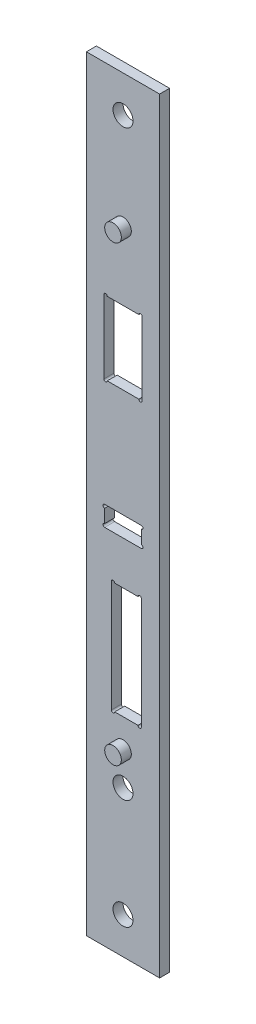
ISO-10303-21;
HEADER;
FILE_DESCRIPTION(('STEP AP214'),'2;1');
FILE_NAME('part.step','',(''),(''),'','','');
FILE_SCHEMA(('AUTOMOTIVE_DESIGN { 1 0 10303 214 1 1 1 1 }'));
ENDSEC;
DATA;
#1=APPLICATION_CONTEXT('core data for automotive mechanical design processes');
#2=APPLICATION_PROTOCOL_DEFINITION('international standard','automotive_design',2000,#1);
#3=PRODUCT_CONTEXT('',#1,'mechanical');
#4=PRODUCT('Part','Part','',(#3));
#5=PRODUCT_RELATED_PRODUCT_CATEGORY('part','',(#4));
#6=PRODUCT_DEFINITION_FORMATION('','',#4);
#7=PRODUCT_DEFINITION_CONTEXT('part definition',#1,'design');
#8=PRODUCT_DEFINITION('design','',#6,#7);
#9=PRODUCT_DEFINITION_SHAPE('','',#8);
#10=(LENGTH_UNIT() NAMED_UNIT(*) SI_UNIT(.MILLI.,.METRE.));
#11=(NAMED_UNIT(*) PLANE_ANGLE_UNIT() SI_UNIT($,.RADIAN.));
#12=(NAMED_UNIT(*) SI_UNIT($,.STERADIAN.) SOLID_ANGLE_UNIT());
#13=UNCERTAINTY_MEASURE_WITH_UNIT(LENGTH_MEASURE(1.E-05),#10,'distance_accuracy_value','');
#14=(GEOMETRIC_REPRESENTATION_CONTEXT(3) GLOBAL_UNCERTAINTY_ASSIGNED_CONTEXT((#13)) GLOBAL_UNIT_ASSIGNED_CONTEXT((#10,
#11,#12)) REPRESENTATION_CONTEXT('',''));
#15=CARTESIAN_POINT('',(0.,0.,0.));
#16=DIRECTION('',(0.,0.,1.));
#17=DIRECTION('',(1.,0.,0.));
#18=AXIS2_PLACEMENT_3D('',#15,#16,#17);
#19=CARTESIAN_POINT('',(-11.,-115.,1.5));
#20=DIRECTION('',(0.,0.,1.));
#21=DIRECTION('',(1.,0.,0.));
#22=AXIS2_PLACEMENT_3D('',#19,#20,#21);
#23=PLANE('',#22);
#24=CARTESIAN_POINT('',(0.,75.,1.5));
#25=DIRECTION('',(0.,0.,1.));
#26=DIRECTION('',(1.,0.,0.));
#27=AXIS2_PLACEMENT_3D('',#24,#25,#26);
#28=CIRCLE('',#27,2.5);
#29=CARTESIAN_POINT('',(2.50000000000004,75.,1.5));
#30=VERTEX_POINT('',#29);
#31=EDGE_CURVE('E618',#30,#30,#28,.T.);
#32=ORIENTED_EDGE('',*,*,#31,.F.);
#33=EDGE_LOOP('',(#32));
#34=FACE_BOUND('',#33,.T.);
#35=CARTESIAN_POINT('',(-2.99999999999997,-19.,1.5));
#36=DIRECTION('',(0.,0.,1.));
#37=DIRECTION('',(1.,0.,0.));
#38=AXIS2_PLACEMENT_3D('',#35,#36,#37);
#39=CIRCLE('',#38,0.499999999999999);
#40=CARTESIAN_POINT('',(-2.49999999999997,-19.,1.5));
#41=VERTEX_POINT('',#40);
#42=CARTESIAN_POINT('',(-3.49999999999996,-19.,1.5));
#43=VERTEX_POINT('',#42);
#44=EDGE_CURVE('E55',#41,#43,#39,.T.);
#45=ORIENTED_EDGE('',*,*,#44,.F.);
#46=DIRECTION('',(-1.,0.,0.));
#47=VECTOR('',#46,1.);
#48=CARTESIAN_POINT('',(-2.49999999999997,-19.,1.5));
#49=LINE('',#48,#47);
#50=CARTESIAN_POINT('',(4.50000000000004,-19.,1.5));
#51=VERTEX_POINT('',#50);
#52=EDGE_CURVE('E225',#51,#41,#49,.T.);
#53=ORIENTED_EDGE('',*,*,#52,.F.);
#54=CARTESIAN_POINT('',(5.00000000000003,-19.,1.5));
#55=DIRECTION('',(0.,0.,1.));
#56=DIRECTION('',(-1.,0.,0.));
#57=AXIS2_PLACEMENT_3D('',#54,#55,#56);
#58=CIRCLE('',#57,0.5);
#59=CARTESIAN_POINT('',(5.50000000000003,-19.,1.5));
#60=VERTEX_POINT('',#59);
#61=EDGE_CURVE('E259',#60,#51,#58,.T.);
#62=ORIENTED_EDGE('',*,*,#61,.F.);
#63=DIRECTION('',(0.,1.,0.));
#64=VECTOR('',#63,1.);
#65=CARTESIAN_POINT('',(5.50000000000003,-19.,1.5));
#66=LINE('',#65,#64);
#67=CARTESIAN_POINT('',(5.50000000000004,-52.5,1.5));
#68=VERTEX_POINT('',#67);
#69=EDGE_CURVE('E256',#68,#60,#66,.T.);
#70=ORIENTED_EDGE('',*,*,#69,.F.);
#71=CARTESIAN_POINT('',(5.00000000000003,-52.5,1.5));
#72=DIRECTION('',(0.,0.,1.));
#73=DIRECTION('',(-1.,0.,0.));
#74=AXIS2_PLACEMENT_3D('',#71,#72,#73);
#75=CIRCLE('',#74,0.500000000000002);
#76=CARTESIAN_POINT('',(4.50000000000003,-52.5,1.5));
#77=VERTEX_POINT('',#76);
#78=EDGE_CURVE('E253',#77,#68,#75,.T.);
#79=ORIENTED_EDGE('',*,*,#78,.F.);
#80=DIRECTION('',(1.,0.,0.));
#81=VECTOR('',#80,1.);
#82=CARTESIAN_POINT('',(-2.49999999999997,-52.5,1.5));
#83=LINE('',#82,#81);
#84=CARTESIAN_POINT('',(-2.49999999999997,-52.5,1.5));
#85=VERTEX_POINT('',#84);
#86=EDGE_CURVE('E250',#85,#77,#83,.T.);
#87=ORIENTED_EDGE('',*,*,#86,.F.);
#88=CARTESIAN_POINT('',(-2.99999999999997,-52.5,1.5));
#89=DIRECTION('',(0.,0.,1.));
#90=DIRECTION('',(1.,0.,0.));
#91=AXIS2_PLACEMENT_3D('',#88,#89,#90);
#92=CIRCLE('',#91,0.499999999999999);
#93=CARTESIAN_POINT('',(-3.49999999999997,-52.5,1.5));
#94=VERTEX_POINT('',#93);
#95=EDGE_CURVE('E247',#94,#85,#92,.T.);
#96=ORIENTED_EDGE('',*,*,#95,.F.);
#97=DIRECTION('',(0.,-1.,0.));
#98=VECTOR('',#97,1.);
#99=CARTESIAN_POINT('',(-3.49999999999997,-19.,1.5));
#100=LINE('',#99,#98);
#101=EDGE_CURVE('E240',#43,#94,#100,.T.);
#102=ORIENTED_EDGE('',*,*,#101,.F.);
#103=EDGE_LOOP('',(#45,#53,#62,#70,#79,#87,#96,#102));
#104=FACE_BOUND('',#103,.T.);
#105=CARTESIAN_POINT('',(-5.5,-0.5,1.5));
#106=DIRECTION('',(0.,0.,1.));
#107=DIRECTION('',(1.,0.,0.));
#108=AXIS2_PLACEMENT_3D('',#105,#106,#107);
#109=CIRCLE('',#108,0.5);
#110=CARTESIAN_POINT('',(-5.5,0.,1.5));
#111=VERTEX_POINT('',#110);
#112=CARTESIAN_POINT('',(-5.5,-1.,1.5));
#113=VERTEX_POINT('',#112);
#114=EDGE_CURVE('E295',#111,#113,#109,.T.);
#115=ORIENTED_EDGE('',*,*,#114,.F.);
#116=DIRECTION('',(-1.,0.,0.));
#117=VECTOR('',#116,1.);
#118=CARTESIAN_POINT('',(-5.5,0.,1.5));
#119=LINE('',#118,#117);
#120=CARTESIAN_POINT('',(5.5,0.,1.5));
#121=VERTEX_POINT('',#120);
#122=EDGE_CURVE('E315',#121,#111,#119,.T.);
#123=ORIENTED_EDGE('',*,*,#122,.F.);
#124=CARTESIAN_POINT('',(5.5,-0.5,1.5));
#125=DIRECTION('',(0.,0.,1.));
#126=DIRECTION('',(-1.,0.,0.));
#127=AXIS2_PLACEMENT_3D('',#124,#125,#126);
#128=CIRCLE('',#127,0.5);
#129=CARTESIAN_POINT('',(5.5,-1.,1.5));
#130=VERTEX_POINT('',#129);
#131=EDGE_CURVE('E312',#130,#121,#128,.T.);
#132=ORIENTED_EDGE('',*,*,#131,.F.);
#133=DIRECTION('',(0.,1.,0.));
#134=VECTOR('',#133,1.);
#135=CARTESIAN_POINT('',(5.5,-1.,1.5));
#136=LINE('',#135,#134);
#137=CARTESIAN_POINT('',(5.5,-5.,1.5));
#138=VERTEX_POINT('',#137);
#139=EDGE_CURVE('E309',#138,#130,#136,.T.);
#140=ORIENTED_EDGE('',*,*,#139,.F.);
#141=CARTESIAN_POINT('',(5.5,-5.5,1.5));
#142=DIRECTION('',(0.,0.,1.));
#143=DIRECTION('',(-1.,0.,0.));
#144=AXIS2_PLACEMENT_3D('',#141,#142,#143);
#145=CIRCLE('',#144,0.5);
#146=CARTESIAN_POINT('',(5.5,-6.,1.5));
#147=VERTEX_POINT('',#146);
#148=EDGE_CURVE('E306',#147,#138,#145,.T.);
#149=ORIENTED_EDGE('',*,*,#148,.F.);
#150=DIRECTION('',(1.,0.,0.));
#151=VECTOR('',#150,1.);
#152=CARTESIAN_POINT('',(-5.5,-6.,1.5));
#153=LINE('',#152,#151);
#154=CARTESIAN_POINT('',(-5.5,-6.,1.5));
#155=VERTEX_POINT('',#154);
#156=EDGE_CURVE('E303',#155,#147,#153,.T.);
#157=ORIENTED_EDGE('',*,*,#156,.F.);
#158=CARTESIAN_POINT('',(-5.5,-5.5,1.5));
#159=DIRECTION('',(0.,0.,1.));
#160=DIRECTION('',(1.,0.,0.));
#161=AXIS2_PLACEMENT_3D('',#158,#159,#160);
#162=CIRCLE('',#161,0.5);
#163=CARTESIAN_POINT('',(-5.5,-5.,1.5));
#164=VERTEX_POINT('',#163);
#165=EDGE_CURVE('E300',#164,#155,#162,.T.);
#166=ORIENTED_EDGE('',*,*,#165,.F.);
#167=DIRECTION('',(0.,-1.,0.));
#168=VECTOR('',#167,1.);
#169=CARTESIAN_POINT('',(-5.5,-1.,1.5));
#170=LINE('',#169,#168);
#171=EDGE_CURVE('E297',#113,#164,#170,.T.);
#172=ORIENTED_EDGE('',*,*,#171,.F.);
#173=EDGE_LOOP('',(#115,#123,#132,#140,#149,#157,#166,#172));
#174=FACE_BOUND('',#173,.T.);
#175=CARTESIAN_POINT('',(-5.25,54.5,1.5));
#176=DIRECTION('',(0.,0.,1.));
#177=DIRECTION('',(1.,0.,0.));
#178=AXIS2_PLACEMENT_3D('',#175,#176,#177);
#179=CIRCLE('',#178,0.5);
#180=CARTESIAN_POINT('',(-4.75,54.5,1.5));
#181=VERTEX_POINT('',#180);
#182=CARTESIAN_POINT('',(-5.75,54.5,1.5));
#183=VERTEX_POINT('',#182);
#184=EDGE_CURVE('E358',#181,#183,#179,.T.);
#185=ORIENTED_EDGE('',*,*,#184,.F.);
#186=DIRECTION('',(-1.,0.,0.));
#187=VECTOR('',#186,1.);
#188=CARTESIAN_POINT('',(-4.75,54.5,1.5));
#189=LINE('',#188,#187);
#190=CARTESIAN_POINT('',(4.75,54.5,1.5));
#191=VERTEX_POINT('',#190);
#192=EDGE_CURVE('E378',#191,#181,#189,.T.);
#193=ORIENTED_EDGE('',*,*,#192,.F.);
#194=CARTESIAN_POINT('',(5.25,54.5,1.5));
#195=DIRECTION('',(0.,0.,1.));
#196=DIRECTION('',(1.,0.,0.));
#197=AXIS2_PLACEMENT_3D('',#194,#195,#196);
#198=CIRCLE('',#197,0.5);
#199=CARTESIAN_POINT('',(5.75,54.5,1.5));
#200=VERTEX_POINT('',#199);
#201=EDGE_CURVE('E375',#200,#191,#198,.T.);
#202=ORIENTED_EDGE('',*,*,#201,.F.);
#203=DIRECTION('',(0.,1.,0.));
#204=VECTOR('',#203,1.);
#205=CARTESIAN_POINT('',(5.75,54.5,1.5));
#206=LINE('',#205,#204);
#207=CARTESIAN_POINT('',(5.75,32.5,1.5));
#208=VERTEX_POINT('',#207);
#209=EDGE_CURVE('E372',#208,#200,#206,.T.);
#210=ORIENTED_EDGE('',*,*,#209,.F.);
#211=CARTESIAN_POINT('',(5.25,32.5,1.5));
#212=DIRECTION('',(0.,0.,1.));
#213=DIRECTION('',(-1.,0.,0.));
#214=AXIS2_PLACEMENT_3D('',#211,#212,#213);
#215=CIRCLE('',#214,0.5);
#216=CARTESIAN_POINT('',(4.75,32.5,1.5));
#217=VERTEX_POINT('',#216);
#218=EDGE_CURVE('E369',#217,#208,#215,.T.);
#219=ORIENTED_EDGE('',*,*,#218,.F.);
#220=DIRECTION('',(1.,0.,0.));
#221=VECTOR('',#220,1.);
#222=CARTESIAN_POINT('',(-4.75,32.5,1.5));
#223=LINE('',#222,#221);
#224=CARTESIAN_POINT('',(-4.75,32.5,1.5));
#225=VERTEX_POINT('',#224);
#226=EDGE_CURVE('E366',#225,#217,#223,.T.);
#227=ORIENTED_EDGE('',*,*,#226,.F.);
#228=CARTESIAN_POINT('',(-5.25,32.5,1.5));
#229=DIRECTION('',(0.,0.,1.));
#230=DIRECTION('',(1.,0.,0.));
#231=AXIS2_PLACEMENT_3D('',#228,#229,#230);
#232=CIRCLE('',#231,0.5);
#233=CARTESIAN_POINT('',(-5.75,32.5,1.5));
#234=VERTEX_POINT('',#233);
#235=EDGE_CURVE('E363',#234,#225,#232,.T.);
#236=ORIENTED_EDGE('',*,*,#235,.F.);
#237=DIRECTION('',(0.,-1.,0.));
#238=VECTOR('',#237,1.);
#239=CARTESIAN_POINT('',(-5.75,54.5,1.5));
#240=LINE('',#239,#238);
#241=EDGE_CURVE('E360',#183,#234,#240,.T.);
#242=ORIENTED_EDGE('',*,*,#241,.F.);
#243=EDGE_LOOP('',(#185,#193,#202,#210,#219,#227,#236,#242));
#244=FACE_BOUND('',#243,.T.);
#245=CARTESIAN_POINT('',(0.,104.,1.5));
#246=DIRECTION('',(0.,0.,1.));
#247=DIRECTION('',(1.,0.,0.));
#248=AXIS2_PLACEMENT_3D('',#245,#246,#247);
#249=CIRCLE('',#248,3.);
#250=CARTESIAN_POINT('',(3.00000000000004,104.,1.5));
#251=VERTEX_POINT('',#250);
#252=EDGE_CURVE('E401',#251,#251,#249,.T.);
#253=ORIENTED_EDGE('',*,*,#252,.F.);
#254=EDGE_LOOP('',(#253));
#255=FACE_BOUND('',#254,.T.);
#256=CARTESIAN_POINT('',(0.,-71.,1.5));
#257=DIRECTION('',(0.,0.,1.));
#258=DIRECTION('',(1.,0.,0.));
#259=AXIS2_PLACEMENT_3D('',#256,#257,#258);
#260=CIRCLE('',#259,3.);
#261=CARTESIAN_POINT('',(3.,-71.,1.5));
#262=VERTEX_POINT('',#261);
#263=EDGE_CURVE('E407',#262,#262,#260,.T.);
#264=ORIENTED_EDGE('',*,*,#263,.F.);
#265=EDGE_LOOP('',(#264));
#266=FACE_BOUND('',#265,.T.);
#267=CARTESIAN_POINT('',(0.,-104.,1.5));
#268=DIRECTION('',(0.,0.,1.));
#269=DIRECTION('',(1.,0.,0.));
#270=AXIS2_PLACEMENT_3D('',#267,#268,#269);
#271=CIRCLE('',#270,3.);
#272=CARTESIAN_POINT('',(3.,-104.,1.5));
#273=VERTEX_POINT('',#272);
#274=EDGE_CURVE('E413',#273,#273,#271,.T.);
#275=ORIENTED_EDGE('',*,*,#274,.F.);
#276=EDGE_LOOP('',(#275));
#277=FACE_BOUND('',#276,.T.);
#278=DIRECTION('',(0.,-1.,0.));
#279=VECTOR('',#278,1.);
#280=CARTESIAN_POINT('',(-11.,115.,1.5));
#281=LINE('',#280,#279);
#282=CARTESIAN_POINT('',(-11.,115.,1.5));
#283=VERTEX_POINT('',#282);
#284=CARTESIAN_POINT('',(-11.,-115.,1.5));
#285=VERTEX_POINT('',#284);
#286=EDGE_CURVE('E420',#283,#285,#281,.T.);
#287=ORIENTED_EDGE('',*,*,#286,.T.);
#288=DIRECTION('',(1.,0.,0.));
#289=VECTOR('',#288,1.);
#290=CARTESIAN_POINT('',(-11.,-115.,1.5));
#291=LINE('',#290,#289);
#292=CARTESIAN_POINT('',(11.,-115.,1.5));
#293=VERTEX_POINT('',#292);
#294=EDGE_CURVE('E424',#285,#293,#291,.T.);
#295=ORIENTED_EDGE('',*,*,#294,.T.);
#296=DIRECTION('',(0.,1.,0.));
#297=VECTOR('',#296,1.);
#298=CARTESIAN_POINT('',(11.,115.,1.5));
#299=LINE('',#298,#297);
#300=CARTESIAN_POINT('',(11.,115.,1.5));
#301=VERTEX_POINT('',#300);
#302=EDGE_CURVE('E427',#293,#301,#299,.T.);
#303=ORIENTED_EDGE('',*,*,#302,.T.);
#304=DIRECTION('',(-1.,0.,0.));
#305=VECTOR('',#304,1.);
#306=CARTESIAN_POINT('',(-11.,115.,1.5));
#307=LINE('',#306,#305);
#308=EDGE_CURVE('E430',#301,#283,#307,.T.);
#309=ORIENTED_EDGE('',*,*,#308,.T.);
#310=EDGE_LOOP('',(#287,#295,#303,#309));
#311=FACE_BOUND('',#310,.T.);
#312=CARTESIAN_POINT('',(0.,-61.,1.5));
#313=DIRECTION('',(0.,0.,1.));
#314=DIRECTION('',(1.,0.,0.));
#315=AXIS2_PLACEMENT_3D('',#312,#313,#314);
#316=CIRCLE('',#315,2.5);
#317=CARTESIAN_POINT('',(2.50000000000004,-61.,1.5));
#318=VERTEX_POINT('',#317);
#319=EDGE_CURVE('E619',#318,#318,#316,.T.);
#320=ORIENTED_EDGE('',*,*,#319,.F.);
#321=EDGE_LOOP('',(#320));
#322=FACE_BOUND('',#321,.T.);
#323=ADVANCED_FACE('F32',(#34,#104,#174,#244,#255,#266,#277,#311,#322),#23,.T.);
#324=CARTESIAN_POINT('',(-11.,-115.,-1.5));
#325=DIRECTION('',(0.,0.,1.));
#326=DIRECTION('',(1.,0.,0.));
#327=AXIS2_PLACEMENT_3D('',#324,#325,#326);
#328=PLANE('',#327);
#329=DIRECTION('',(1.,0.,0.));
#330=VECTOR('',#329,1.);
#331=CARTESIAN_POINT('',(-2.49999999999997,-19.,-1.5));
#332=LINE('',#331,#330);
#333=CARTESIAN_POINT('',(-2.49999999999997,-19.,-1.5));
#334=VERTEX_POINT('',#333);
#335=CARTESIAN_POINT('',(4.50000000000004,-19.,-1.5));
#336=VERTEX_POINT('',#335);
#337=EDGE_CURVE('E238',#334,#336,#332,.T.);
#338=ORIENTED_EDGE('',*,*,#337,.F.);
#339=CARTESIAN_POINT('',(-2.99999999999997,-19.,-1.5));
#340=DIRECTION('',(0.,0.,1.));
#341=DIRECTION('',(1.,0.,0.));
#342=AXIS2_PLACEMENT_3D('',#339,#340,#341);
#343=CIRCLE('',#342,0.499999999999999);
#344=CARTESIAN_POINT('',(-3.49999999999997,-19.,-1.5));
#345=VERTEX_POINT('',#344);
#346=EDGE_CURVE('E219',#345,#334,#343,.F.);
#347=ORIENTED_EDGE('',*,*,#346,.F.);
#348=DIRECTION('',(0.,1.,0.));
#349=VECTOR('',#348,1.);
#350=CARTESIAN_POINT('',(-3.49999999999997,-19.,-1.5));
#351=LINE('',#350,#349);
#352=CARTESIAN_POINT('',(-3.49999999999997,-52.5,-1.5));
#353=VERTEX_POINT('',#352);
#354=EDGE_CURVE('E228',#353,#345,#351,.T.);
#355=ORIENTED_EDGE('',*,*,#354,.F.);
#356=CARTESIAN_POINT('',(-2.99999999999997,-52.5,-1.5));
#357=DIRECTION('',(0.,0.,1.));
#358=DIRECTION('',(1.,0.,0.));
#359=AXIS2_PLACEMENT_3D('',#356,#357,#358);
#360=CIRCLE('',#359,0.499999999999999);
#361=CARTESIAN_POINT('',(-2.49999999999997,-52.5,-1.5));
#362=VERTEX_POINT('',#361);
#363=EDGE_CURVE('E47',#362,#353,#360,.F.);
#364=ORIENTED_EDGE('',*,*,#363,.F.);
#365=DIRECTION('',(-1.,0.,0.));
#366=VECTOR('',#365,1.);
#367=CARTESIAN_POINT('',(-2.49999999999997,-52.5,-1.5));
#368=LINE('',#367,#366);
#369=CARTESIAN_POINT('',(4.50000000000003,-52.5,-1.5));
#370=VERTEX_POINT('',#369);
#371=EDGE_CURVE('E630',#370,#362,#368,.T.);
#372=ORIENTED_EDGE('',*,*,#371,.F.);
#373=CARTESIAN_POINT('',(5.00000000000003,-52.5,-1.5));
#374=DIRECTION('',(0.,0.,1.));
#375=DIRECTION('',(1.,0.,0.));
#376=AXIS2_PLACEMENT_3D('',#373,#374,#375);
#377=CIRCLE('',#376,0.500000000000002);
#378=CARTESIAN_POINT('',(5.50000000000004,-52.5,-1.5));
#379=VERTEX_POINT('',#378);
#380=EDGE_CURVE('E633',#379,#370,#377,.F.);
#381=ORIENTED_EDGE('',*,*,#380,.F.);
#382=DIRECTION('',(0.,-1.,0.));
#383=VECTOR('',#382,1.);
#384=CARTESIAN_POINT('',(5.50000000000003,-19.,-1.5));
#385=LINE('',#384,#383);
#386=CARTESIAN_POINT('',(5.50000000000003,-19.,-1.5));
#387=VERTEX_POINT('',#386);
#388=EDGE_CURVE('E636',#387,#379,#385,.T.);
#389=ORIENTED_EDGE('',*,*,#388,.F.);
#390=CARTESIAN_POINT('',(5.00000000000003,-19.,-1.5));
#391=DIRECTION('',(0.,0.,1.));
#392=DIRECTION('',(1.,0.,0.));
#393=AXIS2_PLACEMENT_3D('',#390,#391,#392);
#394=CIRCLE('',#393,0.5);
#395=EDGE_CURVE('E242',#336,#387,#394,.F.);
#396=ORIENTED_EDGE('',*,*,#395,.F.);
#397=EDGE_LOOP('',(#338,#347,#355,#364,#372,#381,#389,#396));
#398=FACE_BOUND('',#397,.T.);
#399=DIRECTION('',(1.,0.,0.));
#400=VECTOR('',#399,1.);
#401=CARTESIAN_POINT('',(-5.5,0.,-1.5));
#402=LINE('',#401,#400);
#403=CARTESIAN_POINT('',(-5.5,0.,-1.5));
#404=VERTEX_POINT('',#403);
#405=CARTESIAN_POINT('',(5.5,0.,-1.5));
#406=VERTEX_POINT('',#405);
#407=EDGE_CURVE('E289',#404,#406,#402,.T.);
#408=ORIENTED_EDGE('',*,*,#407,.F.);
#409=CARTESIAN_POINT('',(-5.5,-0.5,-1.5));
#410=DIRECTION('',(0.,0.,1.));
#411=DIRECTION('',(1.,0.,0.));
#412=AXIS2_PLACEMENT_3D('',#409,#410,#411);
#413=CIRCLE('',#412,0.5);
#414=CARTESIAN_POINT('',(-5.5,-1.,-1.5));
#415=VERTEX_POINT('',#414);
#416=EDGE_CURVE('E292',#415,#404,#413,.F.);
#417=ORIENTED_EDGE('',*,*,#416,.F.);
#418=DIRECTION('',(0.,1.,0.));
#419=VECTOR('',#418,1.);
#420=CARTESIAN_POINT('',(-5.5,-1.,-1.5));
#421=LINE('',#420,#419);
#422=CARTESIAN_POINT('',(-5.5,-5.,-1.5));
#423=VERTEX_POINT('',#422);
#424=EDGE_CURVE('E321',#423,#415,#421,.T.);
#425=ORIENTED_EDGE('',*,*,#424,.F.);
#426=CARTESIAN_POINT('',(-5.5,-5.5,-1.5));
#427=DIRECTION('',(0.,0.,1.));
#428=DIRECTION('',(1.,0.,0.));
#429=AXIS2_PLACEMENT_3D('',#426,#427,#428);
#430=CIRCLE('',#429,0.5);
#431=CARTESIAN_POINT('',(-5.5,-6.,-1.5));
#432=VERTEX_POINT('',#431);
#433=EDGE_CURVE('E231',#432,#423,#430,.F.);
#434=ORIENTED_EDGE('',*,*,#433,.F.);
#435=DIRECTION('',(-1.,0.,0.));
#436=VECTOR('',#435,1.);
#437=CARTESIAN_POINT('',(-5.5,-6.,-1.5));
#438=LINE('',#437,#436);
#439=CARTESIAN_POINT('',(5.5,-6.,-1.5));
#440=VERTEX_POINT('',#439);
#441=EDGE_CURVE('E277',#440,#432,#438,.T.);
#442=ORIENTED_EDGE('',*,*,#441,.F.);
#443=CARTESIAN_POINT('',(5.5,-5.5,-1.5));
#444=DIRECTION('',(0.,0.,1.));
#445=DIRECTION('',(1.,0.,0.));
#446=AXIS2_PLACEMENT_3D('',#443,#444,#445);
#447=CIRCLE('',#446,0.5);
#448=CARTESIAN_POINT('',(5.5,-5.,-1.5));
#449=VERTEX_POINT('',#448);
#450=EDGE_CURVE('E280',#449,#440,#447,.F.);
#451=ORIENTED_EDGE('',*,*,#450,.F.);
#452=DIRECTION('',(0.,-1.,0.));
#453=VECTOR('',#452,1.);
#454=CARTESIAN_POINT('',(5.5,-1.,-1.5));
#455=LINE('',#454,#453);
#456=CARTESIAN_POINT('',(5.5,-1.,-1.5));
#457=VERTEX_POINT('',#456);
#458=EDGE_CURVE('E283',#457,#449,#455,.T.);
#459=ORIENTED_EDGE('',*,*,#458,.F.);
#460=CARTESIAN_POINT('',(5.5,-0.5,-1.5));
#461=DIRECTION('',(0.,0.,1.));
#462=DIRECTION('',(1.,0.,0.));
#463=AXIS2_PLACEMENT_3D('',#460,#461,#462);
#464=CIRCLE('',#463,0.5);
#465=EDGE_CURVE('E286',#406,#457,#464,.F.);
#466=ORIENTED_EDGE('',*,*,#465,.F.);
#467=EDGE_LOOP('',(#408,#417,#425,#434,#442,#451,#459,#466));
#468=FACE_BOUND('',#467,.T.);
#469=DIRECTION('',(1.,0.,0.));
#470=VECTOR('',#469,1.);
#471=CARTESIAN_POINT('',(-4.75,54.5,-1.5));
#472=LINE('',#471,#470);
#473=CARTESIAN_POINT('',(-4.75,54.5,-1.5));
#474=VERTEX_POINT('',#473);
#475=CARTESIAN_POINT('',(4.75,54.5,-1.5));
#476=VERTEX_POINT('',#475);
#477=EDGE_CURVE('E352',#474,#476,#472,.T.);
#478=ORIENTED_EDGE('',*,*,#477,.F.);
#479=CARTESIAN_POINT('',(-5.25,54.5,-1.5));
#480=DIRECTION('',(0.,0.,1.));
#481=DIRECTION('',(1.,0.,0.));
#482=AXIS2_PLACEMENT_3D('',#479,#480,#481);
#483=CIRCLE('',#482,0.5);
#484=CARTESIAN_POINT('',(-5.75,54.5,-1.5));
#485=VERTEX_POINT('',#484);
#486=EDGE_CURVE('E355',#485,#474,#483,.F.);
#487=ORIENTED_EDGE('',*,*,#486,.F.);
#488=DIRECTION('',(0.,1.,0.));
#489=VECTOR('',#488,1.);
#490=CARTESIAN_POINT('',(-5.75,54.5,-1.5));
#491=LINE('',#490,#489);
#492=CARTESIAN_POINT('',(-5.75,32.5,-1.5));
#493=VERTEX_POINT('',#492);
#494=EDGE_CURVE('E384',#493,#485,#491,.T.);
#495=ORIENTED_EDGE('',*,*,#494,.F.);
#496=CARTESIAN_POINT('',(-5.25,32.5,-1.5));
#497=DIRECTION('',(0.,0.,1.));
#498=DIRECTION('',(1.,0.,0.));
#499=AXIS2_PLACEMENT_3D('',#496,#497,#498);
#500=CIRCLE('',#499,0.5);
#501=CARTESIAN_POINT('',(-4.75,32.5,-1.5));
#502=VERTEX_POINT('',#501);
#503=EDGE_CURVE('E338',#502,#493,#500,.F.);
#504=ORIENTED_EDGE('',*,*,#503,.F.);
#505=DIRECTION('',(-1.,0.,0.));
#506=VECTOR('',#505,1.);
#507=CARTESIAN_POINT('',(-4.75,32.5,-1.5));
#508=LINE('',#507,#506);
#509=CARTESIAN_POINT('',(4.75,32.5,-1.5));
#510=VERTEX_POINT('',#509);
#511=EDGE_CURVE('E340',#510,#502,#508,.T.);
#512=ORIENTED_EDGE('',*,*,#511,.F.);
#513=CARTESIAN_POINT('',(5.25,32.5,-1.5));
#514=DIRECTION('',(0.,0.,1.));
#515=DIRECTION('',(1.,0.,0.));
#516=AXIS2_PLACEMENT_3D('',#513,#514,#515);
#517=CIRCLE('',#516,0.5);
#518=CARTESIAN_POINT('',(5.75,32.5,-1.5));
#519=VERTEX_POINT('',#518);
#520=EDGE_CURVE('E343',#519,#510,#517,.F.);
#521=ORIENTED_EDGE('',*,*,#520,.F.);
#522=DIRECTION('',(0.,-1.,0.));
#523=VECTOR('',#522,1.);
#524=CARTESIAN_POINT('',(5.75,54.5,-1.5));
#525=LINE('',#524,#523);
#526=CARTESIAN_POINT('',(5.75,54.5,-1.5));
#527=VERTEX_POINT('',#526);
#528=EDGE_CURVE('E346',#527,#519,#525,.T.);
#529=ORIENTED_EDGE('',*,*,#528,.F.);
#530=CARTESIAN_POINT('',(5.25,54.5,-1.5));
#531=DIRECTION('',(0.,0.,1.));
#532=DIRECTION('',(1.,0.,0.));
#533=AXIS2_PLACEMENT_3D('',#530,#531,#532);
#534=CIRCLE('',#533,0.5);
#535=EDGE_CURVE('E349',#476,#527,#534,.F.);
#536=ORIENTED_EDGE('',*,*,#535,.F.);
#537=EDGE_LOOP('',(#478,#487,#495,#504,#512,#521,#529,#536));
#538=FACE_BOUND('',#537,.T.);
#539=CARTESIAN_POINT('',(0.,104.,-1.5));
#540=DIRECTION('',(0.,0.,1.));
#541=DIRECTION('',(1.,0.,0.));
#542=AXIS2_PLACEMENT_3D('',#539,#540,#541);
#543=CIRCLE('',#542,3.);
#544=CARTESIAN_POINT('',(3.00000000000004,104.,-1.5));
#545=VERTEX_POINT('',#544);
#546=EDGE_CURVE('E404',#545,#545,#543,.F.);
#547=ORIENTED_EDGE('',*,*,#546,.F.);
#548=EDGE_LOOP('',(#547));
#549=FACE_BOUND('',#548,.T.);
#550=CARTESIAN_POINT('',(0.,-71.,-1.5));
#551=DIRECTION('',(0.,0.,1.));
#552=DIRECTION('',(1.,0.,0.));
#553=AXIS2_PLACEMENT_3D('',#550,#551,#552);
#554=CIRCLE('',#553,3.);
#555=CARTESIAN_POINT('',(3.,-71.,-1.5));
#556=VERTEX_POINT('',#555);
#557=EDGE_CURVE('E410',#556,#556,#554,.F.);
#558=ORIENTED_EDGE('',*,*,#557,.F.);
#559=EDGE_LOOP('',(#558));
#560=FACE_BOUND('',#559,.T.);
#561=DIRECTION('',(0.,-1.,0.));
#562=VECTOR('',#561,1.);
#563=CARTESIAN_POINT('',(-11.,115.,-1.5));
#564=LINE('',#563,#562);
#565=CARTESIAN_POINT('',(-11.,115.,-1.5));
#566=VERTEX_POINT('',#565);
#567=CARTESIAN_POINT('',(-11.,-115.,-1.5));
#568=VERTEX_POINT('',#567);
#569=EDGE_CURVE('E419',#566,#568,#564,.T.);
#570=ORIENTED_EDGE('',*,*,#569,.F.);
#571=DIRECTION('',(-1.,0.,0.));
#572=VECTOR('',#571,1.);
#573=CARTESIAN_POINT('',(-11.,115.,-1.5));
#574=LINE('',#573,#572);
#575=CARTESIAN_POINT('',(11.,115.,-1.5));
#576=VERTEX_POINT('',#575);
#577=EDGE_CURVE('E425',#576,#566,#574,.T.);
#578=ORIENTED_EDGE('',*,*,#577,.F.);
#579=DIRECTION('',(0.,1.,0.));
#580=VECTOR('',#579,1.);
#581=CARTESIAN_POINT('',(11.,115.,-1.5));
#582=LINE('',#581,#580);
#583=CARTESIAN_POINT('',(11.,-115.,-1.5));
#584=VERTEX_POINT('',#583);
#585=EDGE_CURVE('E437',#584,#576,#582,.T.);
#586=ORIENTED_EDGE('',*,*,#585,.F.);
#587=DIRECTION('',(1.,0.,0.));
#588=VECTOR('',#587,1.);
#589=CARTESIAN_POINT('',(-11.,-115.,-1.5));
#590=LINE('',#589,#588);
#591=EDGE_CURVE('E435',#568,#584,#590,.T.);
#592=ORIENTED_EDGE('',*,*,#591,.F.);
#593=EDGE_LOOP('',(#570,#578,#586,#592));
#594=FACE_BOUND('',#593,.T.);
#595=CARTESIAN_POINT('',(0.,-104.,-1.5));
#596=DIRECTION('',(0.,0.,1.));
#597=DIRECTION('',(1.,0.,0.));
#598=AXIS2_PLACEMENT_3D('',#595,#596,#597);
#599=CIRCLE('',#598,3.);
#600=CARTESIAN_POINT('',(3.,-104.,-1.5));
#601=VERTEX_POINT('',#600);
#602=EDGE_CURVE('E416',#601,#601,#599,.F.);
#603=ORIENTED_EDGE('',*,*,#602,.F.);
#604=EDGE_LOOP('',(#603));
#605=FACE_BOUND('',#604,.T.);
#606=ADVANCED_FACE('F234',(#398,#468,#538,#549,#560,#594,#605),#328,.F.);
#607=CARTESIAN_POINT('',(-11.,115.,1.5));
#608=DIRECTION('',(1.,0.,0.));
#609=DIRECTION('',(0.,1.,0.));
#610=AXIS2_PLACEMENT_3D('',#607,#608,#609);
#611=PLANE('',#610);
#612=ORIENTED_EDGE('',*,*,#569,.T.);
#613=DIRECTION('',(0.,0.,-1.));
#614=VECTOR('',#613,1.);
#615=CARTESIAN_POINT('',(-11.,-115.,1.5));
#616=LINE('',#615,#614);
#617=EDGE_CURVE('E11',#285,#568,#616,.T.);
#618=ORIENTED_EDGE('',*,*,#617,.F.);
#619=ORIENTED_EDGE('',*,*,#286,.F.);
#620=DIRECTION('',(0.,0.,-1.));
#621=VECTOR('',#620,1.);
#622=CARTESIAN_POINT('',(-11.,115.,1.5));
#623=LINE('',#622,#621);
#624=EDGE_CURVE('E432',#283,#566,#623,.T.);
#625=ORIENTED_EDGE('',*,*,#624,.T.);
#626=EDGE_LOOP('',(#612,#618,#619,#625));
#627=FACE_BOUND('',#626,.T.);
#628=ADVANCED_FACE('F34',(#627),#611,.F.);
#629=CARTESIAN_POINT('',(-11.,-115.,1.5));
#630=DIRECTION('',(0.,1.,0.));
#631=DIRECTION('',(0.,0.,1.));
#632=AXIS2_PLACEMENT_3D('',#629,#630,#631);
#633=PLANE('',#632);
#634=ORIENTED_EDGE('',*,*,#591,.T.);
#635=DIRECTION('',(0.,0.,-1.));
#636=VECTOR('',#635,1.);
#637=CARTESIAN_POINT('',(11.,-115.,1.5));
#638=LINE('',#637,#636);
#639=EDGE_CURVE('E40',#293,#584,#638,.T.);
#640=ORIENTED_EDGE('',*,*,#639,.F.);
#641=ORIENTED_EDGE('',*,*,#294,.F.);
#642=ORIENTED_EDGE('',*,*,#617,.T.);
#643=EDGE_LOOP('',(#634,#640,#641,#642));
#644=FACE_BOUND('',#643,.T.);
#645=ADVANCED_FACE('F465',(#644),#633,.F.);
#646=CARTESIAN_POINT('',(11.,115.,1.5));
#647=DIRECTION('',(-1.,0.,0.));
#648=DIRECTION('',(0.,-1.,0.));
#649=AXIS2_PLACEMENT_3D('',#646,#647,#648);
#650=PLANE('',#649);
#651=ORIENTED_EDGE('',*,*,#585,.T.);
#652=DIRECTION('',(0.,0.,-1.));
#653=VECTOR('',#652,1.);
#654=CARTESIAN_POINT('',(11.,115.,1.5));
#655=LINE('',#654,#653);
#656=EDGE_CURVE('E442',#301,#576,#655,.T.);
#657=ORIENTED_EDGE('',*,*,#656,.F.);
#658=ORIENTED_EDGE('',*,*,#302,.F.);
#659=ORIENTED_EDGE('',*,*,#639,.T.);
#660=EDGE_LOOP('',(#651,#657,#658,#659));
#661=FACE_BOUND('',#660,.T.);
#662=ADVANCED_FACE('F449',(#661),#650,.F.);
#663=CARTESIAN_POINT('',(-11.,115.,1.5));
#664=DIRECTION('',(0.,-1.,0.));
#665=DIRECTION('',(0.,0.,-1.));
#666=AXIS2_PLACEMENT_3D('',#663,#664,#665);
#667=PLANE('',#666);
#668=ORIENTED_EDGE('',*,*,#577,.T.);
#669=ORIENTED_EDGE('',*,*,#624,.F.);
#670=ORIENTED_EDGE('',*,*,#308,.F.);
#671=ORIENTED_EDGE('',*,*,#656,.T.);
#672=EDGE_LOOP('',(#668,#669,#670,#671));
#673=FACE_BOUND('',#672,.T.);
#674=ADVANCED_FACE('F458',(#673),#667,.F.);
#675=CARTESIAN_POINT('',(0.,-104.,1.5));
#676=DIRECTION('',(0.,0.,1.));
#677=DIRECTION('',(1.,0.,0.));
#678=AXIS2_PLACEMENT_3D('',#675,#676,#677);
#679=CYLINDRICAL_SURFACE('',#678,3.);
#680=ORIENTED_EDGE('',*,*,#602,.T.);
#681=EDGE_LOOP('',(#680));
#682=FACE_BOUND('',#681,.T.);
#683=ORIENTED_EDGE('',*,*,#274,.T.);
#684=EDGE_LOOP('',(#683));
#685=FACE_BOUND('',#684,.T.);
#686=ADVANCED_FACE('F482',(#682,#685),#679,.F.);
#687=CARTESIAN_POINT('',(0.,-71.,1.5));
#688=DIRECTION('',(0.,0.,1.));
#689=DIRECTION('',(1.,0.,0.));
#690=AXIS2_PLACEMENT_3D('',#687,#688,#689);
#691=CYLINDRICAL_SURFACE('',#690,3.);
#692=ORIENTED_EDGE('',*,*,#557,.T.);
#693=EDGE_LOOP('',(#692));
#694=FACE_BOUND('',#693,.T.);
#695=ORIENTED_EDGE('',*,*,#263,.T.);
#696=EDGE_LOOP('',(#695));
#697=FACE_BOUND('',#696,.T.);
#698=ADVANCED_FACE('F489',(#694,#697),#691,.F.);
#699=CARTESIAN_POINT('',(0.,104.,1.5));
#700=DIRECTION('',(0.,0.,1.));
#701=DIRECTION('',(1.,0.,0.));
#702=AXIS2_PLACEMENT_3D('',#699,#700,#701);
#703=CYLINDRICAL_SURFACE('',#702,3.);
#704=ORIENTED_EDGE('',*,*,#546,.T.);
#705=EDGE_LOOP('',(#704));
#706=FACE_BOUND('',#705,.T.);
#707=ORIENTED_EDGE('',*,*,#252,.T.);
#708=EDGE_LOOP('',(#707));
#709=FACE_BOUND('',#708,.T.);
#710=ADVANCED_FACE('F494',(#706,#709),#703,.F.);
#711=CARTESIAN_POINT('',(-5.25,54.5,-1.501));
#712=DIRECTION('',(0.,0.,1.));
#713=DIRECTION('',(1.,0.,0.));
#714=AXIS2_PLACEMENT_3D('',#711,#712,#713);
#715=CYLINDRICAL_SURFACE('',#714,0.5);
#716=ORIENTED_EDGE('',*,*,#486,.T.);
#717=DIRECTION('',(0.,0.,1.));
#718=VECTOR('',#717,1.);
#719=CARTESIAN_POINT('',(-4.75,54.5,-1.501));
#720=LINE('',#719,#718);
#721=EDGE_CURVE('E382',#474,#181,#720,.T.);
#722=ORIENTED_EDGE('',*,*,#721,.T.);
#723=ORIENTED_EDGE('',*,*,#184,.T.);
#724=DIRECTION('',(0.,0.,1.));
#725=VECTOR('',#724,1.);
#726=CARTESIAN_POINT('',(-5.75,54.5,-1.501));
#727=LINE('',#726,#725);
#728=EDGE_CURVE('E381',#485,#183,#727,.T.);
#729=ORIENTED_EDGE('',*,*,#728,.F.);
#730=EDGE_LOOP('',(#716,#722,#723,#729));
#731=FACE_BOUND('',#730,.T.);
#732=ADVANCED_FACE('F503',(#731),#715,.F.);
#733=CARTESIAN_POINT('',(-4.75,54.5,-1.501));
#734=DIRECTION('',(0.,1.,0.));
#735=DIRECTION('',(-1.,0.,0.));
#736=AXIS2_PLACEMENT_3D('',#733,#734,#735);
#737=PLANE('',#736);
#738=ORIENTED_EDGE('',*,*,#477,.T.);
#739=DIRECTION('',(0.,0.,1.));
#740=VECTOR('',#739,1.);
#741=CARTESIAN_POINT('',(4.75,54.5,-1.501));
#742=LINE('',#741,#740);
#743=EDGE_CURVE('E385',#476,#191,#742,.T.);
#744=ORIENTED_EDGE('',*,*,#743,.T.);
#745=ORIENTED_EDGE('',*,*,#192,.T.);
#746=ORIENTED_EDGE('',*,*,#721,.F.);
#747=EDGE_LOOP('',(#738,#744,#745,#746));
#748=FACE_BOUND('',#747,.T.);
#749=ADVANCED_FACE('F510',(#748),#737,.F.);
#750=CARTESIAN_POINT('',(5.25,54.5,-1.501));
#751=DIRECTION('',(0.,0.,1.));
#752=DIRECTION('',(1.,0.,0.));
#753=AXIS2_PLACEMENT_3D('',#750,#751,#752);
#754=CYLINDRICAL_SURFACE('',#753,0.5);
#755=ORIENTED_EDGE('',*,*,#535,.T.);
#756=DIRECTION('',(0.,0.,1.));
#757=VECTOR('',#756,1.);
#758=CARTESIAN_POINT('',(5.75,54.5,-1.501));
#759=LINE('',#758,#757);
#760=EDGE_CURVE('E387',#527,#200,#759,.T.);
#761=ORIENTED_EDGE('',*,*,#760,.T.);
#762=ORIENTED_EDGE('',*,*,#201,.T.);
#763=ORIENTED_EDGE('',*,*,#743,.F.);
#764=EDGE_LOOP('',(#755,#761,#762,#763));
#765=FACE_BOUND('',#764,.T.);
#766=ADVANCED_FACE('F532',(#765),#754,.F.);
#767=CARTESIAN_POINT('',(5.75,54.5,-1.501));
#768=DIRECTION('',(1.,0.,0.));
#769=DIRECTION('',(0.,1.,0.));
#770=AXIS2_PLACEMENT_3D('',#767,#768,#769);
#771=PLANE('',#770);
#772=ORIENTED_EDGE('',*,*,#528,.T.);
#773=DIRECTION('',(0.,0.,1.));
#774=VECTOR('',#773,1.);
#775=CARTESIAN_POINT('',(5.75,32.5,-1.501));
#776=LINE('',#775,#774);
#777=EDGE_CURVE('E389',#519,#208,#776,.T.);
#778=ORIENTED_EDGE('',*,*,#777,.T.);
#779=ORIENTED_EDGE('',*,*,#209,.T.);
#780=ORIENTED_EDGE('',*,*,#760,.F.);
#781=EDGE_LOOP('',(#772,#778,#779,#780));
#782=FACE_BOUND('',#781,.T.);
#783=ADVANCED_FACE('F528',(#782),#771,.F.);
#784=CARTESIAN_POINT('',(5.25,32.5,-1.501));
#785=DIRECTION('',(0.,0.,1.));
#786=DIRECTION('',(1.,0.,0.));
#787=AXIS2_PLACEMENT_3D('',#784,#785,#786);
#788=CYLINDRICAL_SURFACE('',#787,0.5);
#789=ORIENTED_EDGE('',*,*,#520,.T.);
#790=DIRECTION('',(0.,0.,1.));
#791=VECTOR('',#790,1.);
#792=CARTESIAN_POINT('',(4.75,32.5,-1.501));
#793=LINE('',#792,#791);
#794=EDGE_CURVE('E391',#510,#217,#793,.T.);
#795=ORIENTED_EDGE('',*,*,#794,.T.);
#796=ORIENTED_EDGE('',*,*,#218,.T.);
#797=ORIENTED_EDGE('',*,*,#777,.F.);
#798=EDGE_LOOP('',(#789,#795,#796,#797));
#799=FACE_BOUND('',#798,.T.);
#800=ADVANCED_FACE('F524',(#799),#788,.F.);
#801=CARTESIAN_POINT('',(-4.75,32.5,-1.501));
#802=DIRECTION('',(0.,-1.,0.));
#803=DIRECTION('',(1.,0.,0.));
#804=AXIS2_PLACEMENT_3D('',#801,#802,#803);
#805=PLANE('',#804);
#806=ORIENTED_EDGE('',*,*,#511,.T.);
#807=DIRECTION('',(0.,0.,1.));
#808=VECTOR('',#807,1.);
#809=CARTESIAN_POINT('',(-4.75,32.5,-1.501));
#810=LINE('',#809,#808);
#811=EDGE_CURVE('E393',#502,#225,#810,.T.);
#812=ORIENTED_EDGE('',*,*,#811,.T.);
#813=ORIENTED_EDGE('',*,*,#226,.T.);
#814=ORIENTED_EDGE('',*,*,#794,.F.);
#815=EDGE_LOOP('',(#806,#812,#813,#814));
#816=FACE_BOUND('',#815,.T.);
#817=ADVANCED_FACE('F520',(#816),#805,.F.);
#818=CARTESIAN_POINT('',(-5.25,32.5,-1.501));
#819=DIRECTION('',(0.,0.,1.));
#820=DIRECTION('',(1.,0.,0.));
#821=AXIS2_PLACEMENT_3D('',#818,#819,#820);
#822=CYLINDRICAL_SURFACE('',#821,0.5);
#823=ORIENTED_EDGE('',*,*,#503,.T.);
#824=DIRECTION('',(0.,0.,1.));
#825=VECTOR('',#824,1.);
#826=CARTESIAN_POINT('',(-5.75,32.5,-1.501));
#827=LINE('',#826,#825);
#828=EDGE_CURVE('E395',#493,#234,#827,.T.);
#829=ORIENTED_EDGE('',*,*,#828,.T.);
#830=ORIENTED_EDGE('',*,*,#235,.T.);
#831=ORIENTED_EDGE('',*,*,#811,.F.);
#832=EDGE_LOOP('',(#823,#829,#830,#831));
#833=FACE_BOUND('',#832,.T.);
#834=ADVANCED_FACE('F516',(#833),#822,.F.);
#835=CARTESIAN_POINT('',(-5.75,54.5,-1.501));
#836=DIRECTION('',(-1.,0.,0.));
#837=DIRECTION('',(0.,-1.,0.));
#838=AXIS2_PLACEMENT_3D('',#835,#836,#837);
#839=PLANE('',#838);
#840=ORIENTED_EDGE('',*,*,#494,.T.);
#841=ORIENTED_EDGE('',*,*,#728,.T.);
#842=ORIENTED_EDGE('',*,*,#241,.T.);
#843=ORIENTED_EDGE('',*,*,#828,.F.);
#844=EDGE_LOOP('',(#840,#841,#842,#843));
#845=FACE_BOUND('',#844,.T.);
#846=ADVANCED_FACE('F512',(#845),#839,.F.);
#847=CARTESIAN_POINT('',(-5.5,-0.5,-1.501));
#848=DIRECTION('',(0.,0.,1.));
#849=DIRECTION('',(1.,0.,0.));
#850=AXIS2_PLACEMENT_3D('',#847,#848,#849);
#851=CYLINDRICAL_SURFACE('',#850,0.5);
#852=ORIENTED_EDGE('',*,*,#416,.T.);
#853=DIRECTION('',(0.,0.,1.));
#854=VECTOR('',#853,1.);
#855=CARTESIAN_POINT('',(-5.5,0.,-1.501));
#856=LINE('',#855,#854);
#857=EDGE_CURVE('E319',#404,#111,#856,.T.);
#858=ORIENTED_EDGE('',*,*,#857,.T.);
#859=ORIENTED_EDGE('',*,*,#114,.T.);
#860=DIRECTION('',(0.,0.,1.));
#861=VECTOR('',#860,1.);
#862=CARTESIAN_POINT('',(-5.5,-1.,-1.501));
#863=LINE('',#862,#861);
#864=EDGE_CURVE('E318',#415,#113,#863,.T.);
#865=ORIENTED_EDGE('',*,*,#864,.F.);
#866=EDGE_LOOP('',(#852,#858,#859,#865));
#867=FACE_BOUND('',#866,.T.);
#868=ADVANCED_FACE('F515',(#867),#851,.F.);
#869=CARTESIAN_POINT('',(-5.5,0.,-1.501));
#870=DIRECTION('',(0.,1.,0.));
#871=DIRECTION('',(0.,0.,1.));
#872=AXIS2_PLACEMENT_3D('',#869,#870,#871);
#873=PLANE('',#872);
#874=ORIENTED_EDGE('',*,*,#407,.T.);
#875=DIRECTION('',(0.,0.,1.));
#876=VECTOR('',#875,1.);
#877=CARTESIAN_POINT('',(5.5,0.,-1.501));
#878=LINE('',#877,#876);
#879=EDGE_CURVE('E322',#406,#121,#878,.T.);
#880=ORIENTED_EDGE('',*,*,#879,.T.);
#881=ORIENTED_EDGE('',*,*,#122,.T.);
#882=ORIENTED_EDGE('',*,*,#857,.F.);
#883=EDGE_LOOP('',(#874,#880,#881,#882));
#884=FACE_BOUND('',#883,.T.);
#885=ADVANCED_FACE('F542',(#884),#873,.F.);
#886=CARTESIAN_POINT('',(5.5,-0.5,-1.501));
#887=DIRECTION('',(0.,0.,1.));
#888=DIRECTION('',(1.,0.,0.));
#889=AXIS2_PLACEMENT_3D('',#886,#887,#888);
#890=CYLINDRICAL_SURFACE('',#889,0.5);
#891=ORIENTED_EDGE('',*,*,#465,.T.);
#892=DIRECTION('',(0.,0.,1.));
#893=VECTOR('',#892,1.);
#894=CARTESIAN_POINT('',(5.5,-1.,-1.501));
#895=LINE('',#894,#893);
#896=EDGE_CURVE('E324',#457,#130,#895,.T.);
#897=ORIENTED_EDGE('',*,*,#896,.T.);
#898=ORIENTED_EDGE('',*,*,#131,.T.);
#899=ORIENTED_EDGE('',*,*,#879,.F.);
#900=EDGE_LOOP('',(#891,#897,#898,#899));
#901=FACE_BOUND('',#900,.T.);
#902=ADVANCED_FACE('F563',(#901),#890,.F.);
#903=CARTESIAN_POINT('',(5.5,-1.,-1.501));
#904=DIRECTION('',(1.,0.,0.));
#905=DIRECTION('',(0.,1.,0.));
#906=AXIS2_PLACEMENT_3D('',#903,#904,#905);
#907=PLANE('',#906);
#908=ORIENTED_EDGE('',*,*,#458,.T.);
#909=DIRECTION('',(0.,0.,1.));
#910=VECTOR('',#909,1.);
#911=CARTESIAN_POINT('',(5.5,-5.,-1.501));
#912=LINE('',#911,#910);
#913=EDGE_CURVE('E326',#449,#138,#912,.T.);
#914=ORIENTED_EDGE('',*,*,#913,.T.);
#915=ORIENTED_EDGE('',*,*,#139,.T.);
#916=ORIENTED_EDGE('',*,*,#896,.F.);
#917=EDGE_LOOP('',(#908,#914,#915,#916));
#918=FACE_BOUND('',#917,.T.);
#919=ADVANCED_FACE('F559',(#918),#907,.F.);
#920=CARTESIAN_POINT('',(5.5,-5.5,-1.501));
#921=DIRECTION('',(0.,0.,1.));
#922=DIRECTION('',(1.,0.,0.));
#923=AXIS2_PLACEMENT_3D('',#920,#921,#922);
#924=CYLINDRICAL_SURFACE('',#923,0.5);
#925=ORIENTED_EDGE('',*,*,#450,.T.);
#926=DIRECTION('',(0.,0.,1.));
#927=VECTOR('',#926,1.);
#928=CARTESIAN_POINT('',(5.5,-6.,-1.501));
#929=LINE('',#928,#927);
#930=EDGE_CURVE('E328',#440,#147,#929,.T.);
#931=ORIENTED_EDGE('',*,*,#930,.T.);
#932=ORIENTED_EDGE('',*,*,#148,.T.);
#933=ORIENTED_EDGE('',*,*,#913,.F.);
#934=EDGE_LOOP('',(#925,#931,#932,#933));
#935=FACE_BOUND('',#934,.T.);
#936=ADVANCED_FACE('F555',(#935),#924,.F.);
#937=CARTESIAN_POINT('',(-5.5,-6.,-1.501));
#938=DIRECTION('',(0.,-1.,0.));
#939=DIRECTION('',(0.,0.,-1.));
#940=AXIS2_PLACEMENT_3D('',#937,#938,#939);
#941=PLANE('',#940);
#942=ORIENTED_EDGE('',*,*,#441,.T.);
#943=DIRECTION('',(0.,0.,1.));
#944=VECTOR('',#943,1.);
#945=CARTESIAN_POINT('',(-5.5,-6.,-1.501));
#946=LINE('',#945,#944);
#947=EDGE_CURVE('E330',#432,#155,#946,.T.);
#948=ORIENTED_EDGE('',*,*,#947,.T.);
#949=ORIENTED_EDGE('',*,*,#156,.T.);
#950=ORIENTED_EDGE('',*,*,#930,.F.);
#951=EDGE_LOOP('',(#942,#948,#949,#950));
#952=FACE_BOUND('',#951,.T.);
#953=ADVANCED_FACE('F551',(#952),#941,.F.);
#954=CARTESIAN_POINT('',(-5.5,-5.5,-1.501));
#955=DIRECTION('',(0.,0.,1.));
#956=DIRECTION('',(1.,0.,0.));
#957=AXIS2_PLACEMENT_3D('',#954,#955,#956);
#958=CYLINDRICAL_SURFACE('',#957,0.5);
#959=ORIENTED_EDGE('',*,*,#433,.T.);
#960=DIRECTION('',(0.,0.,1.));
#961=VECTOR('',#960,1.);
#962=CARTESIAN_POINT('',(-5.5,-5.,-1.501));
#963=LINE('',#962,#961);
#964=EDGE_CURVE('E332',#423,#164,#963,.T.);
#965=ORIENTED_EDGE('',*,*,#964,.T.);
#966=ORIENTED_EDGE('',*,*,#165,.T.);
#967=ORIENTED_EDGE('',*,*,#947,.F.);
#968=EDGE_LOOP('',(#959,#965,#966,#967));
#969=FACE_BOUND('',#968,.T.);
#970=ADVANCED_FACE('F547',(#969),#958,.F.);
#971=CARTESIAN_POINT('',(-5.5,-1.,-1.501));
#972=DIRECTION('',(-1.,0.,0.));
#973=DIRECTION('',(0.,-1.,0.));
#974=AXIS2_PLACEMENT_3D('',#971,#972,#973);
#975=PLANE('',#974);
#976=ORIENTED_EDGE('',*,*,#424,.T.);
#977=ORIENTED_EDGE('',*,*,#864,.T.);
#978=ORIENTED_EDGE('',*,*,#171,.T.);
#979=ORIENTED_EDGE('',*,*,#964,.F.);
#980=EDGE_LOOP('',(#976,#977,#978,#979));
#981=FACE_BOUND('',#980,.T.);
#982=ADVANCED_FACE('F544',(#981),#975,.F.);
#983=CARTESIAN_POINT('',(-2.99999999999997,-19.,-1.501));
#984=DIRECTION('',(0.,0.,1.));
#985=DIRECTION('',(1.,0.,0.));
#986=AXIS2_PLACEMENT_3D('',#983,#984,#985);
#987=CYLINDRICAL_SURFACE('',#986,0.499999999999999);
#988=ORIENTED_EDGE('',*,*,#346,.T.);
#989=DIRECTION('',(0.,0.,1.));
#990=VECTOR('',#989,1.);
#991=CARTESIAN_POINT('',(-2.49999999999997,-19.,-1.501));
#992=LINE('',#991,#990);
#993=EDGE_CURVE('E232',#334,#41,#992,.T.);
#994=ORIENTED_EDGE('',*,*,#993,.T.);
#995=ORIENTED_EDGE('',*,*,#44,.T.);
#996=DIRECTION('',(0.,0.,1.));
#997=VECTOR('',#996,1.);
#998=CARTESIAN_POINT('',(-3.49999999999997,-19.,-1.501));
#999=LINE('',#998,#997);
#1000=EDGE_CURVE('E215',#345,#43,#999,.T.);
#1001=ORIENTED_EDGE('',*,*,#1000,.F.);
#1002=EDGE_LOOP('',(#988,#994,#995,#1001));
#1003=FACE_BOUND('',#1002,.T.);
#1004=ADVANCED_FACE('F217',(#1003),#987,.F.);
#1005=CARTESIAN_POINT('',(-2.49999999999997,-19.,-1.501));
#1006=DIRECTION('',(0.,1.,0.));
#1007=DIRECTION('',(0.,0.,1.));
#1008=AXIS2_PLACEMENT_3D('',#1005,#1006,#1007);
#1009=PLANE('',#1008);
#1010=ORIENTED_EDGE('',*,*,#337,.T.);
#1011=DIRECTION('',(0.,0.,1.));
#1012=VECTOR('',#1011,1.);
#1013=CARTESIAN_POINT('',(4.50000000000004,-19.,-1.501));
#1014=LINE('',#1013,#1012);
#1015=EDGE_CURVE('E265',#336,#51,#1014,.T.);
#1016=ORIENTED_EDGE('',*,*,#1015,.T.);
#1017=ORIENTED_EDGE('',*,*,#52,.T.);
#1018=ORIENTED_EDGE('',*,*,#993,.F.);
#1019=EDGE_LOOP('',(#1010,#1016,#1017,#1018));
#1020=FACE_BOUND('',#1019,.T.);
#1021=ADVANCED_FACE('F573',(#1020),#1009,.F.);
#1022=CARTESIAN_POINT('',(5.00000000000003,-19.,-1.501));
#1023=DIRECTION('',(0.,0.,1.));
#1024=DIRECTION('',(1.,0.,0.));
#1025=AXIS2_PLACEMENT_3D('',#1022,#1023,#1024);
#1026=CYLINDRICAL_SURFACE('',#1025,0.5);
#1027=ORIENTED_EDGE('',*,*,#395,.T.);
#1028=DIRECTION('',(0.,0.,1.));
#1029=VECTOR('',#1028,1.);
#1030=CARTESIAN_POINT('',(5.50000000000003,-19.,-1.501));
#1031=LINE('',#1030,#1029);
#1032=EDGE_CURVE('E267',#387,#60,#1031,.T.);
#1033=ORIENTED_EDGE('',*,*,#1032,.T.);
#1034=ORIENTED_EDGE('',*,*,#61,.T.);
#1035=ORIENTED_EDGE('',*,*,#1015,.F.);
#1036=EDGE_LOOP('',(#1027,#1033,#1034,#1035));
#1037=FACE_BOUND('',#1036,.T.);
#1038=ADVANCED_FACE('F591',(#1037),#1026,.F.);
#1039=CARTESIAN_POINT('',(5.50000000000003,-19.,-1.501));
#1040=DIRECTION('',(1.,0.,0.));
#1041=DIRECTION('',(0.,1.,0.));
#1042=AXIS2_PLACEMENT_3D('',#1039,#1040,#1041);
#1043=PLANE('',#1042);
#1044=ORIENTED_EDGE('',*,*,#388,.T.);
#1045=DIRECTION('',(0.,0.,1.));
#1046=VECTOR('',#1045,1.);
#1047=CARTESIAN_POINT('',(5.50000000000004,-52.5,-1.501));
#1048=LINE('',#1047,#1046);
#1049=EDGE_CURVE('E269',#379,#68,#1048,.T.);
#1050=ORIENTED_EDGE('',*,*,#1049,.T.);
#1051=ORIENTED_EDGE('',*,*,#69,.T.);
#1052=ORIENTED_EDGE('',*,*,#1032,.F.);
#1053=EDGE_LOOP('',(#1044,#1050,#1051,#1052));
#1054=FACE_BOUND('',#1053,.T.);
#1055=ADVANCED_FACE('F587',(#1054),#1043,.F.);
#1056=CARTESIAN_POINT('',(5.00000000000003,-52.5,-1.501));
#1057=DIRECTION('',(0.,0.,1.));
#1058=DIRECTION('',(1.,0.,0.));
#1059=AXIS2_PLACEMENT_3D('',#1056,#1057,#1058);
#1060=CYLINDRICAL_SURFACE('',#1059,0.500000000000002);
#1061=ORIENTED_EDGE('',*,*,#380,.T.);
#1062=DIRECTION('',(0.,0.,1.));
#1063=VECTOR('',#1062,1.);
#1064=CARTESIAN_POINT('',(4.50000000000003,-52.5,-1.501));
#1065=LINE('',#1064,#1063);
#1066=EDGE_CURVE('E271',#370,#77,#1065,.T.);
#1067=ORIENTED_EDGE('',*,*,#1066,.T.);
#1068=ORIENTED_EDGE('',*,*,#78,.T.);
#1069=ORIENTED_EDGE('',*,*,#1049,.F.);
#1070=EDGE_LOOP('',(#1061,#1067,#1068,#1069));
#1071=FACE_BOUND('',#1070,.T.);
#1072=ADVANCED_FACE('F583',(#1071),#1060,.F.);
#1073=CARTESIAN_POINT('',(-2.49999999999997,-52.5,-1.501));
#1074=DIRECTION('',(0.,-1.,0.));
#1075=DIRECTION('',(0.,0.,-1.));
#1076=AXIS2_PLACEMENT_3D('',#1073,#1074,#1075);
#1077=PLANE('',#1076);
#1078=ORIENTED_EDGE('',*,*,#371,.T.);
#1079=DIRECTION('',(0.,0.,1.));
#1080=VECTOR('',#1079,1.);
#1081=CARTESIAN_POINT('',(-2.49999999999997,-52.5,-1.501));
#1082=LINE('',#1081,#1080);
#1083=EDGE_CURVE('E273',#362,#85,#1082,.T.);
#1084=ORIENTED_EDGE('',*,*,#1083,.T.);
#1085=ORIENTED_EDGE('',*,*,#86,.T.);
#1086=ORIENTED_EDGE('',*,*,#1066,.F.);
#1087=EDGE_LOOP('',(#1078,#1084,#1085,#1086));
#1088=FACE_BOUND('',#1087,.T.);
#1089=ADVANCED_FACE('F580',(#1088),#1077,.F.);
#1090=CARTESIAN_POINT('',(-2.99999999999997,-52.5,-1.501));
#1091=DIRECTION('',(0.,0.,1.));
#1092=DIRECTION('',(1.,0.,0.));
#1093=AXIS2_PLACEMENT_3D('',#1090,#1091,#1092);
#1094=CYLINDRICAL_SURFACE('',#1093,0.499999999999999);
#1095=ORIENTED_EDGE('',*,*,#363,.T.);
#1096=DIRECTION('',(0.,0.,1.));
#1097=VECTOR('',#1096,1.);
#1098=CARTESIAN_POINT('',(-3.49999999999997,-52.5,-1.501));
#1099=LINE('',#1098,#1097);
#1100=EDGE_CURVE('E224',#353,#94,#1099,.T.);
#1101=ORIENTED_EDGE('',*,*,#1100,.T.);
#1102=ORIENTED_EDGE('',*,*,#95,.T.);
#1103=ORIENTED_EDGE('',*,*,#1083,.F.);
#1104=EDGE_LOOP('',(#1095,#1101,#1102,#1103));
#1105=FACE_BOUND('',#1104,.T.);
#1106=ADVANCED_FACE('F577',(#1105),#1094,.F.);
#1107=CARTESIAN_POINT('',(-3.49999999999997,-19.,-1.501));
#1108=DIRECTION('',(-1.,0.,0.));
#1109=DIRECTION('',(0.,-1.,0.));
#1110=AXIS2_PLACEMENT_3D('',#1107,#1108,#1109);
#1111=PLANE('',#1110);
#1112=ORIENTED_EDGE('',*,*,#354,.T.);
#1113=ORIENTED_EDGE('',*,*,#1000,.T.);
#1114=ORIENTED_EDGE('',*,*,#101,.T.);
#1115=ORIENTED_EDGE('',*,*,#1100,.F.);
#1116=EDGE_LOOP('',(#1112,#1113,#1114,#1115));
#1117=FACE_BOUND('',#1116,.T.);
#1118=ADVANCED_FACE('F229',(#1117),#1111,.F.);
#1119=CARTESIAN_POINT('',(0.,75.,4.5));
#1120=DIRECTION('',(0.,0.,-1.));
#1121=DIRECTION('',(-1.,0.,0.));
#1122=AXIS2_PLACEMENT_3D('',#1119,#1120,#1121);
#1123=CYLINDRICAL_SURFACE('',#1122,2.5);
#1124=CARTESIAN_POINT('',(0.,75.,4.5));
#1125=DIRECTION('',(0.,0.,1.));
#1126=DIRECTION('',(1.,0.,0.));
#1127=AXIS2_PLACEMENT_3D('',#1124,#1125,#1126);
#1128=CIRCLE('',#1127,2.5);
#1129=CARTESIAN_POINT('',(2.50000000000004,75.,4.5));
#1130=VERTEX_POINT('',#1129);
#1131=EDGE_CURVE('E622',#1130,#1130,#1128,.T.);
#1132=ORIENTED_EDGE('',*,*,#1131,.F.);
#1133=EDGE_LOOP('',(#1132));
#1134=FACE_BOUND('',#1133,.T.);
#1135=ORIENTED_EDGE('',*,*,#31,.T.);
#1136=EDGE_LOOP('',(#1135));
#1137=FACE_BOUND('',#1136,.T.);
#1138=ADVANCED_FACE('F576',(#1134,#1137),#1123,.T.);
#1139=CARTESIAN_POINT('',(0.,75.,4.5));
#1140=DIRECTION('',(0.,0.,1.));
#1141=DIRECTION('',(1.,0.,0.));
#1142=AXIS2_PLACEMENT_3D('',#1139,#1140,#1141);
#1143=PLANE('',#1142);
#1144=ORIENTED_EDGE('',*,*,#1131,.T.);
#1145=EDGE_LOOP('',(#1144));
#1146=FACE_BOUND('',#1145,.T.);
#1147=ADVANCED_FACE('F601',(#1146),#1143,.T.);
#1148=CARTESIAN_POINT('',(0.,-61.,4.5));
#1149=DIRECTION('',(0.,0.,-1.));
#1150=DIRECTION('',(-1.,0.,0.));
#1151=AXIS2_PLACEMENT_3D('',#1148,#1149,#1150);
#1152=CYLINDRICAL_SURFACE('',#1151,2.5);
#1153=CARTESIAN_POINT('',(0.,-61.,4.5));
#1154=DIRECTION('',(0.,0.,1.));
#1155=DIRECTION('',(1.,0.,0.));
#1156=AXIS2_PLACEMENT_3D('',#1153,#1154,#1155);
#1157=CIRCLE('',#1156,2.5);
#1158=CARTESIAN_POINT('',(2.50000000000004,-61.,4.5));
#1159=VERTEX_POINT('',#1158);
#1160=EDGE_CURVE('E617',#1159,#1159,#1157,.T.);
#1161=ORIENTED_EDGE('',*,*,#1160,.F.);
#1162=EDGE_LOOP('',(#1161));
#1163=FACE_BOUND('',#1162,.T.);
#1164=ORIENTED_EDGE('',*,*,#319,.T.);
#1165=EDGE_LOOP('',(#1164));
#1166=FACE_BOUND('',#1165,.T.);
#1167=ADVANCED_FACE('F605',(#1163,#1166),#1152,.T.);
#1168=CARTESIAN_POINT('',(0.,-61.,4.5));
#1169=DIRECTION('',(0.,0.,1.));
#1170=DIRECTION('',(1.,0.,0.));
#1171=AXIS2_PLACEMENT_3D('',#1168,#1169,#1170);
#1172=PLANE('',#1171);
#1173=ORIENTED_EDGE('',*,*,#1160,.T.);
#1174=EDGE_LOOP('',(#1173));
#1175=FACE_BOUND('',#1174,.T.);
#1176=ADVANCED_FACE('F609',(#1175),#1172,.T.);
#1177=CLOSED_SHELL('',(#323,#606,#628,#645,#662,#674,#686,#698,#710,#732,#749,#766,#783,#800,
#817,#834,#846,#868,#885,#902,#919,#936,#953,#970,#982,#1004,#1021,#1038,#1055,#1072,#1089,
#1106,#1118,#1138,#1147,#1167,#1176));
#1178=MANIFOLD_SOLID_BREP('B2',#1177);
#1179=ADVANCED_BREP_SHAPE_REPRESENTATION('',(#18,#1178),#14);
#1180=SHAPE_DEFINITION_REPRESENTATION(#9,#1179);
ENDSEC;
END-ISO-10303-21;
